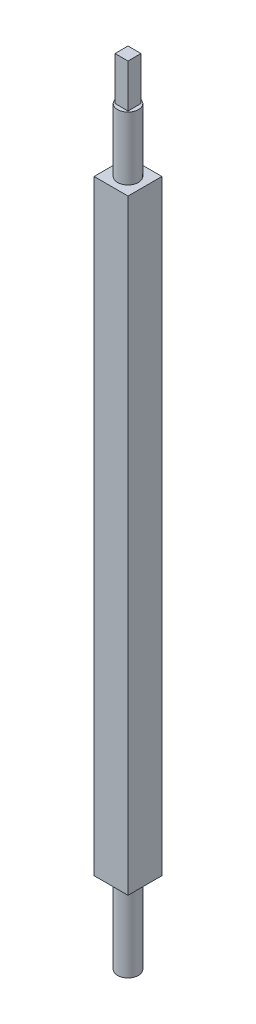
ISO-10303-21;
HEADER;
FILE_DESCRIPTION(('STEP AP214'),'2;1');
FILE_NAME('part.step','',(''),(''),'','','');
FILE_SCHEMA(('AUTOMOTIVE_DESIGN { 1 0 10303 214 1 1 1 1 }'));
ENDSEC;
DATA;
#1=APPLICATION_CONTEXT('core data for automotive mechanical design processes');
#2=APPLICATION_PROTOCOL_DEFINITION('international standard','automotive_design',2000,#1);
#3=PRODUCT_CONTEXT('',#1,'mechanical');
#4=PRODUCT('Part','Part','',(#3));
#5=PRODUCT_RELATED_PRODUCT_CATEGORY('part','',(#4));
#6=PRODUCT_DEFINITION_FORMATION('','',#4);
#7=PRODUCT_DEFINITION_CONTEXT('part definition',#1,'design');
#8=PRODUCT_DEFINITION('design','',#6,#7);
#9=PRODUCT_DEFINITION_SHAPE('','',#8);
#10=(LENGTH_UNIT() NAMED_UNIT(*) SI_UNIT(.MILLI.,.METRE.));
#11=(NAMED_UNIT(*) PLANE_ANGLE_UNIT() SI_UNIT($,.RADIAN.));
#12=(NAMED_UNIT(*) SI_UNIT($,.STERADIAN.) SOLID_ANGLE_UNIT());
#13=UNCERTAINTY_MEASURE_WITH_UNIT(LENGTH_MEASURE(1.E-05),#10,'distance_accuracy_value','');
#14=(GEOMETRIC_REPRESENTATION_CONTEXT(3) GLOBAL_UNCERTAINTY_ASSIGNED_CONTEXT((#13)) GLOBAL_UNIT_ASSIGNED_CONTEXT((#10,
#11,#12)) REPRESENTATION_CONTEXT('',''));
#15=CARTESIAN_POINT('',(0.,0.,0.));
#16=DIRECTION('',(0.,0.,1.));
#17=DIRECTION('',(1.,0.,0.));
#18=AXIS2_PLACEMENT_3D('',#15,#16,#17);
#19=CARTESIAN_POINT('',(0.,235.331,0.));
#20=DIRECTION('',(0.,1.,0.));
#21=DIRECTION('',(0.,0.,1.));
#22=AXIS2_PLACEMENT_3D('',#19,#20,#21);
#23=PLANE('',#22);
#24=CARTESIAN_POINT('',(0.,235.331,0.));
#25=DIRECTION('',(0.,1.,0.));
#26=DIRECTION('',(0.,0.,1.));
#27=AXIS2_PLACEMENT_3D('',#24,#25,#26);
#28=CIRCLE('',#27,3.68046);
#29=CARTESIAN_POINT('',(0.,235.331,3.68046));
#30=VERTEX_POINT('',#29);
#31=EDGE_CURVE('E140',#30,#30,#28,.T.);
#32=ORIENTED_EDGE('',*,*,#31,.T.);
#33=EDGE_LOOP('',(#32));
#34=FACE_BOUND('',#33,.T.);
#35=DIRECTION('',(-1.,0.,0.));
#36=VECTOR('',#35,1.);
#37=CARTESIAN_POINT('',(-2.286,235.331,-2.286));
#38=LINE('',#37,#36);
#39=CARTESIAN_POINT('',(2.286,235.331,-2.286));
#40=VERTEX_POINT('',#39);
#41=CARTESIAN_POINT('',(-2.286,235.331,-2.286));
#42=VERTEX_POINT('',#41);
#43=EDGE_CURVE('E322',#40,#42,#38,.T.);
#44=ORIENTED_EDGE('',*,*,#43,.F.);
#45=DIRECTION('',(0.,0.,-1.));
#46=VECTOR('',#45,1.);
#47=CARTESIAN_POINT('',(2.286,235.331,-2.286));
#48=LINE('',#47,#46);
#49=CARTESIAN_POINT('',(2.286,235.331,2.286));
#50=VERTEX_POINT('',#49);
#51=EDGE_CURVE('E130',#50,#40,#48,.T.);
#52=ORIENTED_EDGE('',*,*,#51,.F.);
#53=DIRECTION('',(1.,0.,0.));
#54=VECTOR('',#53,1.);
#55=CARTESIAN_POINT('',(-2.286,235.331,2.286));
#56=LINE('',#55,#54);
#57=CARTESIAN_POINT('',(-2.286,235.331,2.286));
#58=VERTEX_POINT('',#57);
#59=EDGE_CURVE('E126',#58,#50,#56,.T.);
#60=ORIENTED_EDGE('',*,*,#59,.F.);
#61=DIRECTION('',(0.,0.,1.));
#62=VECTOR('',#61,1.);
#63=CARTESIAN_POINT('',(-2.286,235.331,-2.286));
#64=LINE('',#63,#62);
#65=EDGE_CURVE('E319',#42,#58,#64,.T.);
#66=ORIENTED_EDGE('',*,*,#65,.F.);
#67=EDGE_LOOP('',(#44,#52,#60,#66));
#68=FACE_BOUND('',#67,.T.);
#69=ADVANCED_FACE('F32',(#34,#68),#23,.T.);
#70=CARTESIAN_POINT('',(5.969,213.106,-5.969));
#71=DIRECTION('',(-1.,0.,0.));
#72=DIRECTION('',(0.,0.,1.));
#73=AXIS2_PLACEMENT_3D('',#70,#71,#72);
#74=PLANE('',#73);
#75=DIRECTION('',(0.,0.,-1.));
#76=VECTOR('',#75,1.);
#77=CARTESIAN_POINT('',(5.969,0.,-5.969));
#78=LINE('',#77,#76);
#79=CARTESIAN_POINT('',(5.969,0.,5.969));
#80=VERTEX_POINT('',#79);
#81=CARTESIAN_POINT('',(5.969,0.,-5.969));
#82=VERTEX_POINT('',#81);
#83=EDGE_CURVE('E143',#80,#82,#78,.T.);
#84=ORIENTED_EDGE('',*,*,#83,.T.);
#85=DIRECTION('',(0.,-1.,0.));
#86=VECTOR('',#85,1.);
#87=CARTESIAN_POINT('',(5.969,213.106,-5.969));
#88=LINE('',#87,#86);
#89=CARTESIAN_POINT('',(5.969,213.106,-5.969));
#90=VERTEX_POINT('',#89);
#91=EDGE_CURVE('E40',#90,#82,#88,.T.);
#92=ORIENTED_EDGE('',*,*,#91,.F.);
#93=DIRECTION('',(0.,0.,-1.));
#94=VECTOR('',#93,1.);
#95=CARTESIAN_POINT('',(5.969,213.106,-5.969));
#96=LINE('',#95,#94);
#97=CARTESIAN_POINT('',(5.969,213.106,5.969));
#98=VERTEX_POINT('',#97);
#99=EDGE_CURVE('E146',#98,#90,#96,.T.);
#100=ORIENTED_EDGE('',*,*,#99,.F.);
#101=DIRECTION('',(0.,-1.,0.));
#102=VECTOR('',#101,1.);
#103=CARTESIAN_POINT('',(5.969,213.106,5.969));
#104=LINE('',#103,#102);
#105=EDGE_CURVE('E152',#98,#80,#104,.T.);
#106=ORIENTED_EDGE('',*,*,#105,.T.);
#107=EDGE_LOOP('',(#84,#92,#100,#106));
#108=FACE_BOUND('',#107,.T.);
#109=ADVANCED_FACE('F34',(#108),#74,.F.);
#110=CARTESIAN_POINT('',(-5.969,213.106,-5.969));
#111=DIRECTION('',(0.,0.,1.));
#112=DIRECTION('',(1.,0.,0.));
#113=AXIS2_PLACEMENT_3D('',#110,#111,#112);
#114=PLANE('',#113);
#115=DIRECTION('',(-1.,0.,0.));
#116=VECTOR('',#115,1.);
#117=CARTESIAN_POINT('',(-5.969,0.,-5.969));
#118=LINE('',#117,#116);
#119=CARTESIAN_POINT('',(-5.969,0.,-5.969));
#120=VERTEX_POINT('',#119);
#121=EDGE_CURVE('E155',#82,#120,#118,.T.);
#122=ORIENTED_EDGE('',*,*,#121,.T.);
#123=DIRECTION('',(0.,-1.,0.));
#124=VECTOR('',#123,1.);
#125=CARTESIAN_POINT('',(-5.969,213.106,-5.969));
#126=LINE('',#125,#124);
#127=CARTESIAN_POINT('',(-5.969,213.106,-5.969));
#128=VERTEX_POINT('',#127);
#129=EDGE_CURVE('E163',#128,#120,#126,.T.);
#130=ORIENTED_EDGE('',*,*,#129,.F.);
#131=DIRECTION('',(-1.,0.,0.));
#132=VECTOR('',#131,1.);
#133=CARTESIAN_POINT('',(-5.969,213.106,-5.969));
#134=LINE('',#133,#132);
#135=EDGE_CURVE('E85',#90,#128,#134,.T.);
#136=ORIENTED_EDGE('',*,*,#135,.F.);
#137=ORIENTED_EDGE('',*,*,#91,.T.);
#138=EDGE_LOOP('',(#122,#130,#136,#137));
#139=FACE_BOUND('',#138,.T.);
#140=ADVANCED_FACE('F166',(#139),#114,.F.);
#141=CARTESIAN_POINT('',(-5.969,213.106,-5.969));
#142=DIRECTION('',(1.,0.,0.));
#143=DIRECTION('',(0.,0.,-1.));
#144=AXIS2_PLACEMENT_3D('',#141,#142,#143);
#145=PLANE('',#144);
#146=DIRECTION('',(0.,0.,1.));
#147=VECTOR('',#146,1.);
#148=CARTESIAN_POINT('',(-5.969,0.,-5.969));
#149=LINE('',#148,#147);
#150=CARTESIAN_POINT('',(-5.969,0.,5.969));
#151=VERTEX_POINT('',#150);
#152=EDGE_CURVE('E157',#120,#151,#149,.T.);
#153=ORIENTED_EDGE('',*,*,#152,.T.);
#154=DIRECTION('',(0.,-1.,0.));
#155=VECTOR('',#154,1.);
#156=CARTESIAN_POINT('',(-5.969,213.106,5.969));
#157=LINE('',#156,#155);
#158=CARTESIAN_POINT('',(-5.969,213.106,5.969));
#159=VERTEX_POINT('',#158);
#160=EDGE_CURVE('E161',#159,#151,#157,.T.);
#161=ORIENTED_EDGE('',*,*,#160,.F.);
#162=DIRECTION('',(0.,0.,1.));
#163=VECTOR('',#162,1.);
#164=CARTESIAN_POINT('',(-5.969,213.106,-5.969));
#165=LINE('',#164,#163);
#166=EDGE_CURVE('E149',#128,#159,#165,.T.);
#167=ORIENTED_EDGE('',*,*,#166,.F.);
#168=ORIENTED_EDGE('',*,*,#129,.T.);
#169=EDGE_LOOP('',(#153,#161,#167,#168));
#170=FACE_BOUND('',#169,.T.);
#171=ADVANCED_FACE('F175',(#170),#145,.F.);
#172=CARTESIAN_POINT('',(-5.969,213.106,5.969));
#173=DIRECTION('',(0.,0.,-1.));
#174=DIRECTION('',(-1.,0.,0.));
#175=AXIS2_PLACEMENT_3D('',#172,#173,#174);
#176=PLANE('',#175);
#177=DIRECTION('',(1.,0.,0.));
#178=VECTOR('',#177,1.);
#179=CARTESIAN_POINT('',(-5.969,0.,5.969));
#180=LINE('',#179,#178);
#181=EDGE_CURVE('E77',#151,#80,#180,.T.);
#182=ORIENTED_EDGE('',*,*,#181,.T.);
#183=ORIENTED_EDGE('',*,*,#105,.F.);
#184=DIRECTION('',(1.,0.,0.));
#185=VECTOR('',#184,1.);
#186=CARTESIAN_POINT('',(-5.969,213.106,5.969));
#187=LINE('',#186,#185);
#188=EDGE_CURVE('E56',#159,#98,#187,.T.);
#189=ORIENTED_EDGE('',*,*,#188,.F.);
#190=ORIENTED_EDGE('',*,*,#160,.T.);
#191=EDGE_LOOP('',(#182,#183,#189,#190));
#192=FACE_BOUND('',#191,.T.);
#193=ADVANCED_FACE('F177',(#192),#176,.F.);
#194=CARTESIAN_POINT('',(0.,213.106,0.));
#195=DIRECTION('',(0.,1.,0.));
#196=DIRECTION('',(0.,0.,1.));
#197=AXIS2_PLACEMENT_3D('',#194,#195,#196);
#198=PLANE('',#197);
#199=CARTESIAN_POINT('',(0.,213.106,0.));
#200=DIRECTION('',(0.,1.,0.));
#201=DIRECTION('',(0.,0.,1.));
#202=AXIS2_PLACEMENT_3D('',#199,#200,#201);
#203=CIRCLE('',#202,3.68046);
#204=CARTESIAN_POINT('',(0.,213.106,3.68046));
#205=VERTEX_POINT('',#204);
#206=EDGE_CURVE('E135',#205,#205,#203,.T.);
#207=ORIENTED_EDGE('',*,*,#206,.F.);
#208=EDGE_LOOP('',(#207));
#209=FACE_BOUND('',#208,.T.);
#210=ORIENTED_EDGE('',*,*,#99,.T.);
#211=ORIENTED_EDGE('',*,*,#135,.T.);
#212=ORIENTED_EDGE('',*,*,#166,.T.);
#213=ORIENTED_EDGE('',*,*,#188,.T.);
#214=EDGE_LOOP('',(#210,#211,#212,#213));
#215=FACE_BOUND('',#214,.T.);
#216=ADVANCED_FACE('F178',(#209,#215),#198,.T.);
#217=CARTESIAN_POINT('',(0.,0.,0.));
#218=DIRECTION('',(0.,1.,0.));
#219=DIRECTION('',(0.,0.,1.));
#220=AXIS2_PLACEMENT_3D('',#217,#218,#219);
#221=PLANE('',#220);
#222=CARTESIAN_POINT('',(0.,0.,0.));
#223=DIRECTION('',(0.,1.,0.));
#224=DIRECTION('',(0.,0.,1.));
#225=AXIS2_PLACEMENT_3D('',#222,#223,#224);
#226=CIRCLE('',#225,3.68046);
#227=CARTESIAN_POINT('',(0.,0.,3.68046));
#228=VERTEX_POINT('',#227);
#229=EDGE_CURVE('E11',#228,#228,#226,.F.);
#230=ORIENTED_EDGE('',*,*,#229,.F.);
#231=EDGE_LOOP('',(#230));
#232=FACE_BOUND('',#231,.T.);
#233=ORIENTED_EDGE('',*,*,#83,.F.);
#234=ORIENTED_EDGE('',*,*,#181,.F.);
#235=ORIENTED_EDGE('',*,*,#152,.F.);
#236=ORIENTED_EDGE('',*,*,#121,.F.);
#237=EDGE_LOOP('',(#233,#234,#235,#236));
#238=FACE_BOUND('',#237,.T.);
#239=ADVANCED_FACE('F171',(#232,#238),#221,.F.);
#240=CARTESIAN_POINT('',(0.,235.331,0.));
#241=DIRECTION('',(0.,-1.,0.));
#242=DIRECTION('',(0.,0.,-1.));
#243=AXIS2_PLACEMENT_3D('',#240,#241,#242);
#244=CYLINDRICAL_SURFACE('',#243,3.68046);
#245=ORIENTED_EDGE('',*,*,#31,.F.);
#246=EDGE_LOOP('',(#245));
#247=FACE_BOUND('',#246,.T.);
#248=ORIENTED_EDGE('',*,*,#206,.T.);
#249=EDGE_LOOP('',(#248));
#250=FACE_BOUND('',#249,.T.);
#251=ADVANCED_FACE('F186',(#247,#250),#244,.T.);
#252=CARTESIAN_POINT('',(0.,-28.575,0.));
#253=DIRECTION('',(0.,1.,0.));
#254=DIRECTION('',(0.,0.,1.));
#255=AXIS2_PLACEMENT_3D('',#252,#253,#254);
#256=CYLINDRICAL_SURFACE('',#255,3.68046);
#257=CARTESIAN_POINT('',(0.,-28.575,0.));
#258=DIRECTION('',(0.,-1.,0.));
#259=DIRECTION('',(0.,0.,-1.));
#260=AXIS2_PLACEMENT_3D('',#257,#258,#259);
#261=CIRCLE('',#260,3.68046);
#262=CARTESIAN_POINT('',(0.,-28.575,-3.68046));
#263=VERTEX_POINT('',#262);
#264=EDGE_CURVE('E132',#263,#263,#261,.T.);
#265=ORIENTED_EDGE('',*,*,#264,.F.);
#266=EDGE_LOOP('',(#265));
#267=FACE_BOUND('',#266,.T.);
#268=ORIENTED_EDGE('',*,*,#229,.T.);
#269=EDGE_LOOP('',(#268));
#270=FACE_BOUND('',#269,.T.);
#271=ADVANCED_FACE('F200',(#267,#270),#256,.T.);
#272=CARTESIAN_POINT('',(0.,-28.575,0.));
#273=DIRECTION('',(0.,-1.,0.));
#274=DIRECTION('',(0.,0.,-1.));
#275=AXIS2_PLACEMENT_3D('',#272,#273,#274);
#276=PLANE('',#275);
#277=ORIENTED_EDGE('',*,*,#264,.T.);
#278=EDGE_LOOP('',(#277));
#279=FACE_BOUND('',#278,.T.);
#280=ADVANCED_FACE('F207',(#279),#276,.T.);
#281=CARTESIAN_POINT('',(2.286,250.571,-2.286));
#282=DIRECTION('',(-1.,0.,0.));
#283=DIRECTION('',(0.,0.,1.));
#284=AXIS2_PLACEMENT_3D('',#281,#282,#283);
#285=PLANE('',#284);
#286=ORIENTED_EDGE('',*,*,#51,.T.);
#287=DIRECTION('',(0.,-1.,0.));
#288=VECTOR('',#287,1.);
#289=CARTESIAN_POINT('',(2.286,250.571,-2.286));
#290=LINE('',#289,#288);
#291=CARTESIAN_POINT('',(2.286,250.571,-2.286));
#292=VERTEX_POINT('',#291);
#293=EDGE_CURVE('E111',#292,#40,#290,.T.);
#294=ORIENTED_EDGE('',*,*,#293,.F.);
#295=DIRECTION('',(0.,0.,-1.));
#296=VECTOR('',#295,1.);
#297=CARTESIAN_POINT('',(2.286,250.571,-2.286));
#298=LINE('',#297,#296);
#299=CARTESIAN_POINT('',(2.286,250.571,2.286));
#300=VERTEX_POINT('',#299);
#301=EDGE_CURVE('E118',#300,#292,#298,.T.);
#302=ORIENTED_EDGE('',*,*,#301,.F.);
#303=DIRECTION('',(0.,-1.,0.));
#304=VECTOR('',#303,1.);
#305=CARTESIAN_POINT('',(2.286,250.571,2.286));
#306=LINE('',#305,#304);
#307=EDGE_CURVE('E317',#300,#50,#306,.T.);
#308=ORIENTED_EDGE('',*,*,#307,.T.);
#309=EDGE_LOOP('',(#286,#294,#302,#308));
#310=FACE_BOUND('',#309,.T.);
#311=ADVANCED_FACE('F128',(#310),#285,.F.);
#312=CARTESIAN_POINT('',(-2.286,250.571,-2.286));
#313=DIRECTION('',(0.,0.,1.));
#314=DIRECTION('',(1.,0.,0.));
#315=AXIS2_PLACEMENT_3D('',#312,#313,#314);
#316=PLANE('',#315);
#317=ORIENTED_EDGE('',*,*,#43,.T.);
#318=DIRECTION('',(0.,-1.,0.));
#319=VECTOR('',#318,1.);
#320=CARTESIAN_POINT('',(-2.286,250.571,-2.286));
#321=LINE('',#320,#319);
#322=CARTESIAN_POINT('',(-2.286,250.571,-2.286));
#323=VERTEX_POINT('',#322);
#324=EDGE_CURVE('E114',#323,#42,#321,.T.);
#325=ORIENTED_EDGE('',*,*,#324,.F.);
#326=DIRECTION('',(-1.,0.,0.));
#327=VECTOR('',#326,1.);
#328=CARTESIAN_POINT('',(-2.286,250.571,-2.286));
#329=LINE('',#328,#327);
#330=EDGE_CURVE('E107',#292,#323,#329,.T.);
#331=ORIENTED_EDGE('',*,*,#330,.F.);
#332=ORIENTED_EDGE('',*,*,#293,.T.);
#333=EDGE_LOOP('',(#317,#325,#331,#332));
#334=FACE_BOUND('',#333,.T.);
#335=ADVANCED_FACE('F109',(#334),#316,.F.);
#336=CARTESIAN_POINT('',(-2.286,250.571,-2.286));
#337=DIRECTION('',(1.,0.,0.));
#338=DIRECTION('',(0.,0.,-1.));
#339=AXIS2_PLACEMENT_3D('',#336,#337,#338);
#340=PLANE('',#339);
#341=ORIENTED_EDGE('',*,*,#65,.T.);
#342=DIRECTION('',(0.,-1.,0.));
#343=VECTOR('',#342,1.);
#344=CARTESIAN_POINT('',(-2.286,250.571,2.286));
#345=LINE('',#344,#343);
#346=CARTESIAN_POINT('',(-2.286,250.571,2.286));
#347=VERTEX_POINT('',#346);
#348=EDGE_CURVE('E47',#347,#58,#345,.T.);
#349=ORIENTED_EDGE('',*,*,#348,.F.);
#350=DIRECTION('',(0.,0.,1.));
#351=VECTOR('',#350,1.);
#352=CARTESIAN_POINT('',(-2.286,250.571,-2.286));
#353=LINE('',#352,#351);
#354=EDGE_CURVE('E117',#323,#347,#353,.T.);
#355=ORIENTED_EDGE('',*,*,#354,.F.);
#356=ORIENTED_EDGE('',*,*,#324,.T.);
#357=EDGE_LOOP('',(#341,#349,#355,#356));
#358=FACE_BOUND('',#357,.T.);
#359=ADVANCED_FACE('F225',(#358),#340,.F.);
#360=CARTESIAN_POINT('',(-2.286,250.571,2.286));
#361=DIRECTION('',(0.,0.,-1.));
#362=DIRECTION('',(-1.,0.,0.));
#363=AXIS2_PLACEMENT_3D('',#360,#361,#362);
#364=PLANE('',#363);
#365=ORIENTED_EDGE('',*,*,#59,.T.);
#366=ORIENTED_EDGE('',*,*,#307,.F.);
#367=DIRECTION('',(1.,0.,0.));
#368=VECTOR('',#367,1.);
#369=CARTESIAN_POINT('',(-2.286,250.571,2.286));
#370=LINE('',#369,#368);
#371=EDGE_CURVE('E122',#347,#300,#370,.T.);
#372=ORIENTED_EDGE('',*,*,#371,.F.);
#373=ORIENTED_EDGE('',*,*,#348,.T.);
#374=EDGE_LOOP('',(#365,#366,#372,#373));
#375=FACE_BOUND('',#374,.T.);
#376=ADVANCED_FACE('F228',(#375),#364,.F.);
#377=CARTESIAN_POINT('',(0.,250.571,0.));
#378=DIRECTION('',(0.,1.,0.));
#379=DIRECTION('',(0.,0.,1.));
#380=AXIS2_PLACEMENT_3D('',#377,#378,#379);
#381=PLANE('',#380);
#382=ORIENTED_EDGE('',*,*,#301,.T.);
#383=ORIENTED_EDGE('',*,*,#330,.T.);
#384=ORIENTED_EDGE('',*,*,#354,.T.);
#385=ORIENTED_EDGE('',*,*,#371,.T.);
#386=EDGE_LOOP('',(#382,#383,#384,#385));
#387=FACE_BOUND('',#386,.T.);
#388=ADVANCED_FACE('F121',(#387),#381,.T.);
#389=CLOSED_SHELL('',(#69,#109,#140,#171,#193,#216,#239,#251,#271,#280,#311,#335,#359,#376,#388));
#390=MANIFOLD_SOLID_BREP('B2',#389);
#391=ADVANCED_BREP_SHAPE_REPRESENTATION('',(#18,#390),#14);
#392=SHAPE_DEFINITION_REPRESENTATION(#9,#391);
ENDSEC;
END-ISO-10303-21;
